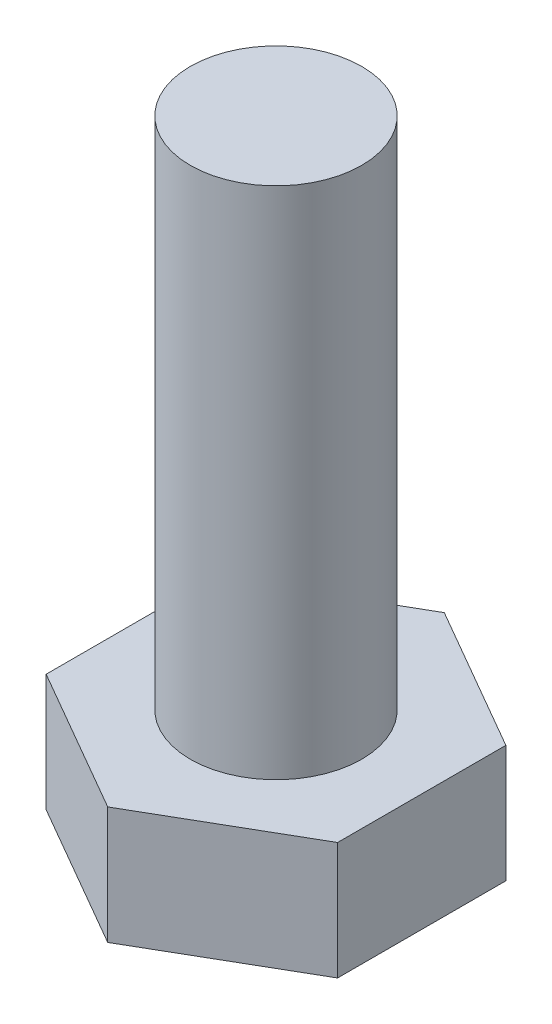
ISO-10303-21;
HEADER;
FILE_DESCRIPTION(('STEP AP214'),'2;1');
FILE_NAME('part.step','',(''),(''),'','','');
FILE_SCHEMA(('AUTOMOTIVE_DESIGN { 1 0 10303 214 1 1 1 1 }'));
ENDSEC;
DATA;
#1=APPLICATION_CONTEXT('core data for automotive mechanical design processes');
#2=APPLICATION_PROTOCOL_DEFINITION('international standard','automotive_design',2000,#1);
#3=PRODUCT_CONTEXT('',#1,'mechanical');
#4=PRODUCT('Part','Part','',(#3));
#5=PRODUCT_RELATED_PRODUCT_CATEGORY('part','',(#4));
#6=PRODUCT_DEFINITION_FORMATION('','',#4);
#7=PRODUCT_DEFINITION_CONTEXT('part definition',#1,'design');
#8=PRODUCT_DEFINITION('design','',#6,#7);
#9=PRODUCT_DEFINITION_SHAPE('','',#8);
#10=(LENGTH_UNIT() NAMED_UNIT(*) SI_UNIT(.MILLI.,.METRE.));
#11=(NAMED_UNIT(*) PLANE_ANGLE_UNIT() SI_UNIT($,.RADIAN.));
#12=(NAMED_UNIT(*) SI_UNIT($,.STERADIAN.) SOLID_ANGLE_UNIT());
#13=UNCERTAINTY_MEASURE_WITH_UNIT(LENGTH_MEASURE(1.E-05),#10,'distance_accuracy_value','');
#14=(GEOMETRIC_REPRESENTATION_CONTEXT(3) GLOBAL_UNCERTAINTY_ASSIGNED_CONTEXT((#13)) GLOBAL_UNIT_ASSIGNED_CONTEXT((#10,
#11,#12)) REPRESENTATION_CONTEXT('',''));
#15=CARTESIAN_POINT('',(0.,0.,0.));
#16=DIRECTION('',(0.,0.,1.));
#17=DIRECTION('',(1.,0.,0.));
#18=AXIS2_PLACEMENT_3D('',#15,#16,#17);
#19=CARTESIAN_POINT('',(0.,8.,0.));
#20=DIRECTION('',(0.,1.,0.));
#21=DIRECTION('',(0.,0.,1.));
#22=AXIS2_PLACEMENT_3D('',#19,#20,#21);
#23=PLANE('',#22);
#24=DIRECTION('',(0.866025403784439,0.,-0.5));
#25=VECTOR('',#24,1.);
#26=CARTESIAN_POINT('',(0.,8.,9.81495457622364));
#27=LINE('',#26,#25);
#28=CARTESIAN_POINT('',(0.,8.,9.81495457622364));
#29=VERTEX_POINT('',#28);
#30=CARTESIAN_POINT('',(8.5,8.,4.90747728811182));
#31=VERTEX_POINT('',#30);
#32=EDGE_CURVE('E118',#29,#31,#27,.T.);
#33=ORIENTED_EDGE('',*,*,#32,.T.);
#34=DIRECTION('',(0.,0.,-1.));
#35=VECTOR('',#34,1.);
#36=CARTESIAN_POINT('',(8.5,8.,4.90747728811182));
#37=LINE('',#36,#35);
#38=CARTESIAN_POINT('',(8.5,8.,-4.90747728811182));
#39=VERTEX_POINT('',#38);
#40=EDGE_CURVE('E107',#31,#39,#37,.T.);
#41=ORIENTED_EDGE('',*,*,#40,.T.);
#42=DIRECTION('',(-0.866025403784439,0.,-0.5));
#43=VECTOR('',#42,1.);
#44=CARTESIAN_POINT('',(8.5,8.,-4.90747728811182));
#45=LINE('',#44,#43);
#46=CARTESIAN_POINT('',(0.,8.,-9.81495457622364));
#47=VERTEX_POINT('',#46);
#48=EDGE_CURVE('E117',#39,#47,#45,.T.);
#49=ORIENTED_EDGE('',*,*,#48,.T.);
#50=DIRECTION('',(-0.866025403784439,0.,0.5));
#51=VECTOR('',#50,1.);
#52=CARTESIAN_POINT('',(0.,8.,-9.81495457622364));
#53=LINE('',#52,#51);
#54=CARTESIAN_POINT('',(-8.5,8.,-4.90747728811182));
#55=VERTEX_POINT('',#54);
#56=EDGE_CURVE('E186',#47,#55,#53,.T.);
#57=ORIENTED_EDGE('',*,*,#56,.T.);
#58=DIRECTION('',(0.,0.,1.));
#59=VECTOR('',#58,1.);
#60=CARTESIAN_POINT('',(-8.5,8.,-4.90747728811182));
#61=LINE('',#60,#59);
#62=CARTESIAN_POINT('',(-8.5,8.,4.90747728811182));
#63=VERTEX_POINT('',#62);
#64=EDGE_CURVE('E188',#55,#63,#61,.T.);
#65=ORIENTED_EDGE('',*,*,#64,.T.);
#66=DIRECTION('',(0.866025403784438,0.,0.5));
#67=VECTOR('',#66,1.);
#68=CARTESIAN_POINT('',(-8.5,8.,4.90747728811182));
#69=LINE('',#68,#67);
#70=EDGE_CURVE('E123',#63,#29,#69,.T.);
#71=ORIENTED_EDGE('',*,*,#70,.T.);
#72=EDGE_LOOP('',(#33,#41,#49,#57,#65,#71));
#73=FACE_BOUND('',#72,.T.);
#74=CARTESIAN_POINT('',(0.,8.,0.));
#75=DIRECTION('',(0.,1.,0.));
#76=DIRECTION('',(0.,0.,1.));
#77=AXIS2_PLACEMENT_3D('',#74,#75,#76);
#78=CIRCLE('',#77,5.);
#79=CARTESIAN_POINT('',(0.,8.,5.));
#80=VERTEX_POINT('',#79);
#81=EDGE_CURVE('E174',#80,#80,#78,.T.);
#82=ORIENTED_EDGE('',*,*,#81,.F.);
#83=EDGE_LOOP('',(#82));
#84=FACE_BOUND('',#83,.T.);
#85=ADVANCED_FACE('F34',(#73,#84),#23,.T.);
#86=CARTESIAN_POINT('',(0.,8.,9.81495457622364));
#87=DIRECTION('',(-0.5,0.,-0.866025403784439));
#88=DIRECTION('',(-0.866025403784439,0.,0.5));
#89=AXIS2_PLACEMENT_3D('',#86,#87,#88);
#90=PLANE('',#89);
#91=DIRECTION('',(0.,-1.,0.));
#92=VECTOR('',#91,1.);
#93=CARTESIAN_POINT('',(0.,8.,9.81495457622364));
#94=LINE('',#93,#92);
#95=CARTESIAN_POINT('',(0.,1.15470053837926,9.81495457622364));
#96=VERTEX_POINT('',#95);
#97=EDGE_CURVE('E191',#29,#96,#94,.T.);
#98=ORIENTED_EDGE('',*,*,#97,.T.);
#99=DIRECTION('',(0.866025403784439,0.,-0.5));
#100=VECTOR('',#99,1.);
#101=CARTESIAN_POINT('',(0.,1.15470053837926,9.81495457622364));
#102=LINE('',#101,#100);
#103=CARTESIAN_POINT('',(8.5,1.15470053837926,4.90747728811182));
#104=VERTEX_POINT('',#103);
#105=EDGE_CURVE('E131',#96,#104,#102,.T.);
#106=ORIENTED_EDGE('',*,*,#105,.T.);
#107=DIRECTION('',(0.,-1.,0.));
#108=VECTOR('',#107,1.);
#109=CARTESIAN_POINT('',(8.5,8.,4.90747728811182));
#110=LINE('',#109,#108);
#111=EDGE_CURVE('E111',#31,#104,#110,.T.);
#112=ORIENTED_EDGE('',*,*,#111,.F.);
#113=ORIENTED_EDGE('',*,*,#32,.F.);
#114=EDGE_LOOP('',(#98,#106,#112,#113));
#115=FACE_BOUND('',#114,.T.);
#116=ADVANCED_FACE('F129',(#115),#90,.F.);
#117=CARTESIAN_POINT('',(8.5,8.,4.90747728811182));
#118=DIRECTION('',(-1.,0.,0.));
#119=DIRECTION('',(0.,0.,1.));
#120=AXIS2_PLACEMENT_3D('',#117,#118,#119);
#121=PLANE('',#120);
#122=ORIENTED_EDGE('',*,*,#111,.T.);
#123=DIRECTION('',(0.,0.,-1.));
#124=VECTOR('',#123,1.);
#125=CARTESIAN_POINT('',(8.5,1.15470053837926,4.90747728811182));
#126=LINE('',#125,#124);
#127=CARTESIAN_POINT('',(8.5,1.15470053837926,-4.90747728811182));
#128=VERTEX_POINT('',#127);
#129=EDGE_CURVE('E153',#104,#128,#126,.T.);
#130=ORIENTED_EDGE('',*,*,#129,.T.);
#131=DIRECTION('',(0.,-1.,0.));
#132=VECTOR('',#131,1.);
#133=CARTESIAN_POINT('',(8.5,8.,-4.90747728811182));
#134=LINE('',#133,#132);
#135=EDGE_CURVE('E114',#39,#128,#134,.T.);
#136=ORIENTED_EDGE('',*,*,#135,.F.);
#137=ORIENTED_EDGE('',*,*,#40,.F.);
#138=EDGE_LOOP('',(#122,#130,#136,#137));
#139=FACE_BOUND('',#138,.T.);
#140=ADVANCED_FACE('F109',(#139),#121,.F.);
#141=CARTESIAN_POINT('',(8.5,8.,-4.90747728811182));
#142=DIRECTION('',(-0.5,0.,0.866025403784439));
#143=DIRECTION('',(0.866025403784439,0.,0.5));
#144=AXIS2_PLACEMENT_3D('',#141,#142,#143);
#145=PLANE('',#144);
#146=ORIENTED_EDGE('',*,*,#135,.T.);
#147=DIRECTION('',(-0.866025403784439,0.,-0.5));
#148=VECTOR('',#147,1.);
#149=CARTESIAN_POINT('',(8.5,1.15470053837926,-4.90747728811182));
#150=LINE('',#149,#148);
#151=CARTESIAN_POINT('',(0.,1.15470053837926,-9.81495457622364));
#152=VERTEX_POINT('',#151);
#153=EDGE_CURVE('E132',#128,#152,#150,.T.);
#154=ORIENTED_EDGE('',*,*,#153,.T.);
#155=DIRECTION('',(0.,-1.,0.));
#156=VECTOR('',#155,1.);
#157=CARTESIAN_POINT('',(0.,8.,-9.81495457622364));
#158=LINE('',#157,#156);
#159=EDGE_CURVE('E137',#47,#152,#158,.T.);
#160=ORIENTED_EDGE('',*,*,#159,.F.);
#161=ORIENTED_EDGE('',*,*,#48,.F.);
#162=EDGE_LOOP('',(#146,#154,#160,#161));
#163=FACE_BOUND('',#162,.T.);
#164=ADVANCED_FACE('F200',(#163),#145,.F.);
#165=CARTESIAN_POINT('',(0.,8.,-9.81495457622364));
#166=DIRECTION('',(0.5,0.,0.866025403784439));
#167=DIRECTION('',(0.866025403784439,0.,-0.5));
#168=AXIS2_PLACEMENT_3D('',#165,#166,#167);
#169=PLANE('',#168);
#170=ORIENTED_EDGE('',*,*,#159,.T.);
#171=DIRECTION('',(-0.866025403784439,0.,0.5));
#172=VECTOR('',#171,1.);
#173=CARTESIAN_POINT('',(0.,1.15470053837926,-9.81495457622364));
#174=LINE('',#173,#172);
#175=CARTESIAN_POINT('',(-8.5,1.15470053837926,-4.90747728811182));
#176=VERTEX_POINT('',#175);
#177=EDGE_CURVE('E11',#152,#176,#174,.T.);
#178=ORIENTED_EDGE('',*,*,#177,.T.);
#179=DIRECTION('',(0.,-1.,0.));
#180=VECTOR('',#179,1.);
#181=CARTESIAN_POINT('',(-8.5,8.,-4.90747728811182));
#182=LINE('',#181,#180);
#183=EDGE_CURVE('E195',#55,#176,#182,.T.);
#184=ORIENTED_EDGE('',*,*,#183,.F.);
#185=ORIENTED_EDGE('',*,*,#56,.F.);
#186=EDGE_LOOP('',(#170,#178,#184,#185));
#187=FACE_BOUND('',#186,.T.);
#188=ADVANCED_FACE('F198',(#187),#169,.F.);
#189=CARTESIAN_POINT('',(-8.5,8.,-4.90747728811182));
#190=DIRECTION('',(1.,0.,0.));
#191=DIRECTION('',(0.,0.,-1.));
#192=AXIS2_PLACEMENT_3D('',#189,#190,#191);
#193=PLANE('',#192);
#194=ORIENTED_EDGE('',*,*,#183,.T.);
#195=DIRECTION('',(0.,0.,1.));
#196=VECTOR('',#195,1.);
#197=CARTESIAN_POINT('',(-8.5,1.15470053837926,-4.90747728811182));
#198=LINE('',#197,#196);
#199=CARTESIAN_POINT('',(-8.5,1.15470053837926,4.90747728811182));
#200=VERTEX_POINT('',#199);
#201=EDGE_CURVE('E43',#176,#200,#198,.T.);
#202=ORIENTED_EDGE('',*,*,#201,.T.);
#203=DIRECTION('',(0.,-1.,0.));
#204=VECTOR('',#203,1.);
#205=CARTESIAN_POINT('',(-8.5,8.,4.90747728811182));
#206=LINE('',#205,#204);
#207=EDGE_CURVE('E193',#63,#200,#206,.T.);
#208=ORIENTED_EDGE('',*,*,#207,.F.);
#209=ORIENTED_EDGE('',*,*,#64,.F.);
#210=EDGE_LOOP('',(#194,#202,#208,#209));
#211=FACE_BOUND('',#210,.T.);
#212=ADVANCED_FACE('F221',(#211),#193,.F.);
#213=CARTESIAN_POINT('',(-8.5,8.,4.90747728811182));
#214=DIRECTION('',(0.5,0.,-0.866025403784438));
#215=DIRECTION('',(-0.866025403784438,0.,-0.5));
#216=AXIS2_PLACEMENT_3D('',#213,#214,#215);
#217=PLANE('',#216);
#218=ORIENTED_EDGE('',*,*,#207,.T.);
#219=DIRECTION('',(0.866025403784438,0.,0.5));
#220=VECTOR('',#219,1.);
#221=CARTESIAN_POINT('',(-8.5,1.15470053837926,4.90747728811182));
#222=LINE('',#221,#220);
#223=EDGE_CURVE('E156',#200,#96,#222,.T.);
#224=ORIENTED_EDGE('',*,*,#223,.T.);
#225=ORIENTED_EDGE('',*,*,#97,.F.);
#226=ORIENTED_EDGE('',*,*,#70,.F.);
#227=EDGE_LOOP('',(#218,#224,#225,#226));
#228=FACE_BOUND('',#227,.T.);
#229=ADVANCED_FACE('F219',(#228),#217,.F.);
#230=CARTESIAN_POINT('',(0.,0.,0.));
#231=DIRECTION('',(0.,1.,0.));
#232=DIRECTION('',(0.,0.,1.));
#233=AXIS2_PLACEMENT_3D('',#230,#231,#232);
#234=PLANE('',#233);
#235=DIRECTION('',(0.866025403784439,0.,-0.5));
#236=VECTOR('',#235,1.);
#237=CARTESIAN_POINT('',(-3.24999999999999,0.,-5.62916512459884));
#238=LINE('',#237,#236);
#239=CARTESIAN_POINT('',(-6.49999999999998,0.,-3.75277674973256));
#240=VERTEX_POINT('',#239);
#241=CARTESIAN_POINT('',(0.,0.,-7.50555349946512));
#242=VERTEX_POINT('',#241);
#243=EDGE_CURVE('E135',#240,#242,#238,.T.);
#244=ORIENTED_EDGE('',*,*,#243,.T.);
#245=DIRECTION('',(0.866025403784439,0.,0.5));
#246=VECTOR('',#245,1.);
#247=CARTESIAN_POINT('',(3.25,0.,-5.62916512459884));
#248=LINE('',#247,#246);
#249=CARTESIAN_POINT('',(6.49999999999998,0.,-3.75277674973256));
#250=VERTEX_POINT('',#249);
#251=EDGE_CURVE('E150',#242,#250,#248,.T.);
#252=ORIENTED_EDGE('',*,*,#251,.T.);
#253=DIRECTION('',(0.,0.,1.));
#254=VECTOR('',#253,1.);
#255=CARTESIAN_POINT('',(6.49999999999998,0.,0.));
#256=LINE('',#255,#254);
#257=CARTESIAN_POINT('',(6.49999999999998,0.,3.75277674973256));
#258=VERTEX_POINT('',#257);
#259=EDGE_CURVE('E148',#250,#258,#256,.T.);
#260=ORIENTED_EDGE('',*,*,#259,.T.);
#261=DIRECTION('',(-0.866025403784439,0.,0.5));
#262=VECTOR('',#261,1.);
#263=CARTESIAN_POINT('',(3.24999999999999,0.,5.62916512459884));
#264=LINE('',#263,#262);
#265=CARTESIAN_POINT('',(0.,0.,7.50555349946512));
#266=VERTEX_POINT('',#265);
#267=EDGE_CURVE('E146',#258,#266,#264,.T.);
#268=ORIENTED_EDGE('',*,*,#267,.T.);
#269=DIRECTION('',(-0.866025403784439,0.,-0.5));
#270=VECTOR('',#269,1.);
#271=CARTESIAN_POINT('',(-3.24999999999999,0.,5.62916512459884));
#272=LINE('',#271,#270);
#273=CARTESIAN_POINT('',(-6.49999999999998,0.,3.75277674973256));
#274=VERTEX_POINT('',#273);
#275=EDGE_CURVE('E144',#266,#274,#272,.T.);
#276=ORIENTED_EDGE('',*,*,#275,.T.);
#277=DIRECTION('',(0.,0.,-1.));
#278=VECTOR('',#277,1.);
#279=CARTESIAN_POINT('',(-6.49999999999998,0.,0.));
#280=LINE('',#279,#278);
#281=EDGE_CURVE('E142',#274,#240,#280,.T.);
#282=ORIENTED_EDGE('',*,*,#281,.T.);
#283=EDGE_LOOP('',(#244,#252,#260,#268,#276,#282));
#284=FACE_BOUND('',#283,.T.);
#285=ADVANCED_FACE('F214',(#284),#234,.F.);
#286=CARTESIAN_POINT('',(0.,37.9999999999999,0.));
#287=DIRECTION('',(0.,-1.,0.));
#288=DIRECTION('',(0.,0.,-1.));
#289=AXIS2_PLACEMENT_3D('',#286,#287,#288);
#290=CYLINDRICAL_SURFACE('',#289,5.);
#291=CARTESIAN_POINT('',(0.,37.9999999999999,0.));
#292=DIRECTION('',(0.,1.,0.));
#293=DIRECTION('',(0.,0.,1.));
#294=AXIS2_PLACEMENT_3D('',#291,#292,#293);
#295=CIRCLE('',#294,5.);
#296=CARTESIAN_POINT('',(0.,37.9999999999999,5.));
#297=VERTEX_POINT('',#296);
#298=EDGE_CURVE('E127',#297,#297,#295,.T.);
#299=ORIENTED_EDGE('',*,*,#298,.F.);
#300=EDGE_LOOP('',(#299));
#301=FACE_BOUND('',#300,.T.);
#302=ORIENTED_EDGE('',*,*,#81,.T.);
#303=EDGE_LOOP('',(#302));
#304=FACE_BOUND('',#303,.T.);
#305=ADVANCED_FACE('F238',(#301,#304),#290,.T.);
#306=CARTESIAN_POINT('',(0.,37.9999999999999,0.));
#307=DIRECTION('',(0.,1.,0.));
#308=DIRECTION('',(0.,0.,1.));
#309=AXIS2_PLACEMENT_3D('',#306,#307,#308);
#310=PLANE('',#309);
#311=ORIENTED_EDGE('',*,*,#298,.T.);
#312=EDGE_LOOP('',(#311));
#313=FACE_BOUND('',#312,.T.);
#314=ADVANCED_FACE('F244',(#313),#310,.T.);
#315=CARTESIAN_POINT('',(-8.5,1.15470053837926,4.90747728811182));
#316=DIRECTION('',(0.249999999999999,0.86602540378444,-0.433012701892218));
#317=DIRECTION('',(0.866025403784438,0.,0.5));
#318=AXIS2_PLACEMENT_3D('',#315,#316,#317);
#319=PLANE('',#318);
#320=DIRECTION('',(-0.774596669241484,0.447213595499956,0.447213595499958));
#321=VECTOR('',#320,1.);
#322=CARTESIAN_POINT('',(-5.1,-0.808290376865466,2.94448637286709));
#323=LINE('',#322,#321);
#324=EDGE_CURVE('E168',#274,#200,#323,.T.);
#325=ORIENTED_EDGE('',*,*,#324,.F.);
#326=ORIENTED_EDGE('',*,*,#275,.F.);
#327=DIRECTION('',(0.,0.447213595499956,0.894427190999917));
#328=VECTOR('',#327,1.);
#329=CARTESIAN_POINT('',(0.,-0.808290376865466,5.88897274573418));
#330=LINE('',#329,#328);
#331=EDGE_CURVE('E38',#96,#266,#330,.F.);
#332=ORIENTED_EDGE('',*,*,#331,.F.);
#333=ORIENTED_EDGE('',*,*,#223,.F.);
#334=EDGE_LOOP('',(#325,#326,#332,#333));
#335=FACE_BOUND('',#334,.T.);
#336=ADVANCED_FACE('F36',(#335),#319,.F.);
#337=CARTESIAN_POINT('',(0.,1.15470053837926,9.81495457622364));
#338=DIRECTION('',(-0.249999999999999,0.86602540378444,-0.433012701892218));
#339=DIRECTION('',(0.866025403784439,0.,-0.5));
#340=AXIS2_PLACEMENT_3D('',#337,#338,#339);
#341=PLANE('',#340);
#342=ORIENTED_EDGE('',*,*,#331,.T.);
#343=ORIENTED_EDGE('',*,*,#267,.F.);
#344=DIRECTION('',(0.774596669241484,0.447213595499956,0.447213595499958));
#345=VECTOR('',#344,1.);
#346=CARTESIAN_POINT('',(5.09999999999999,-0.808290376865468,2.94448637286709));
#347=LINE('',#346,#345);
#348=EDGE_CURVE('E166',#104,#258,#347,.F.);
#349=ORIENTED_EDGE('',*,*,#348,.F.);
#350=ORIENTED_EDGE('',*,*,#105,.F.);
#351=EDGE_LOOP('',(#342,#343,#349,#350));
#352=FACE_BOUND('',#351,.T.);
#353=ADVANCED_FACE('F254',(#352),#341,.F.);
#354=CARTESIAN_POINT('',(-8.5,1.15470053837926,-4.90747728811182));
#355=DIRECTION('',(0.499999999999998,0.86602540378444,0.));
#356=DIRECTION('',(0.,0.,1.));
#357=AXIS2_PLACEMENT_3D('',#354,#355,#356);
#358=PLANE('',#357);
#359=ORIENTED_EDGE('',*,*,#324,.T.);
#360=ORIENTED_EDGE('',*,*,#201,.F.);
#361=DIRECTION('',(-0.774596669241484,0.447213595499956,-0.447213595499959));
#362=VECTOR('',#361,1.);
#363=CARTESIAN_POINT('',(-5.1,-0.808290376865467,-2.94448637286709));
#364=LINE('',#363,#362);
#365=EDGE_CURVE('E163',#240,#176,#364,.T.);
#366=ORIENTED_EDGE('',*,*,#365,.F.);
#367=ORIENTED_EDGE('',*,*,#281,.F.);
#368=EDGE_LOOP('',(#359,#360,#366,#367));
#369=FACE_BOUND('',#368,.T.);
#370=ADVANCED_FACE('F212',(#369),#358,.F.);
#371=CARTESIAN_POINT('',(8.5,1.15470053837926,4.90747728811182));
#372=DIRECTION('',(-0.499999999999998,0.86602540378444,0.));
#373=DIRECTION('',(0.,0.,-1.));
#374=AXIS2_PLACEMENT_3D('',#371,#372,#373);
#375=PLANE('',#374);
#376=ORIENTED_EDGE('',*,*,#348,.T.);
#377=ORIENTED_EDGE('',*,*,#259,.F.);
#378=DIRECTION('',(0.774596669241484,0.447213595499956,-0.447213595499958));
#379=VECTOR('',#378,1.);
#380=CARTESIAN_POINT('',(5.09999999999999,-0.808290376865466,-2.94448637286709));
#381=LINE('',#380,#379);
#382=EDGE_CURVE('E161',#128,#250,#381,.F.);
#383=ORIENTED_EDGE('',*,*,#382,.F.);
#384=ORIENTED_EDGE('',*,*,#129,.F.);
#385=EDGE_LOOP('',(#376,#377,#383,#384));
#386=FACE_BOUND('',#385,.T.);
#387=ADVANCED_FACE('F261',(#386),#375,.F.);
#388=CARTESIAN_POINT('',(0.,1.15470053837926,-9.81495457622364));
#389=DIRECTION('',(0.249999999999999,0.86602540378444,0.433012701892218));
#390=DIRECTION('',(-0.866025403784439,0.,0.5));
#391=AXIS2_PLACEMENT_3D('',#388,#389,#390);
#392=PLANE('',#391);
#393=ORIENTED_EDGE('',*,*,#365,.T.);
#394=ORIENTED_EDGE('',*,*,#177,.F.);
#395=DIRECTION('',(0.,-0.447213595499956,0.894427190999917));
#396=VECTOR('',#395,1.);
#397=CARTESIAN_POINT('',(0.,1.15470053837926,-9.81495457622364));
#398=LINE('',#397,#396);
#399=EDGE_CURVE('E159',#242,#152,#398,.F.);
#400=ORIENTED_EDGE('',*,*,#399,.F.);
#401=ORIENTED_EDGE('',*,*,#243,.F.);
#402=EDGE_LOOP('',(#393,#394,#400,#401));
#403=FACE_BOUND('',#402,.T.);
#404=ADVANCED_FACE('F210',(#403),#392,.F.);
#405=CARTESIAN_POINT('',(8.5,1.15470053837926,-4.90747728811182));
#406=DIRECTION('',(-0.249999999999999,0.866025403784439,0.433012701892218));
#407=DIRECTION('',(-0.866025403784439,0.,-0.5));
#408=AXIS2_PLACEMENT_3D('',#405,#406,#407);
#409=PLANE('',#408);
#410=ORIENTED_EDGE('',*,*,#382,.T.);
#411=ORIENTED_EDGE('',*,*,#251,.F.);
#412=ORIENTED_EDGE('',*,*,#399,.T.);
#413=ORIENTED_EDGE('',*,*,#153,.F.);
#414=EDGE_LOOP('',(#410,#411,#412,#413));
#415=FACE_BOUND('',#414,.T.);
#416=ADVANCED_FACE('F204',(#415),#409,.F.);
#417=CLOSED_SHELL('',(#85,#116,#140,#164,#188,#212,#229,#285,#305,#314,#336,#353,#370,#387,#404,#416));
#418=MANIFOLD_SOLID_BREP('B2',#417);
#419=ADVANCED_BREP_SHAPE_REPRESENTATION('',(#18,#418),#14);
#420=SHAPE_DEFINITION_REPRESENTATION(#9,#419);
ENDSEC;
END-ISO-10303-21;
